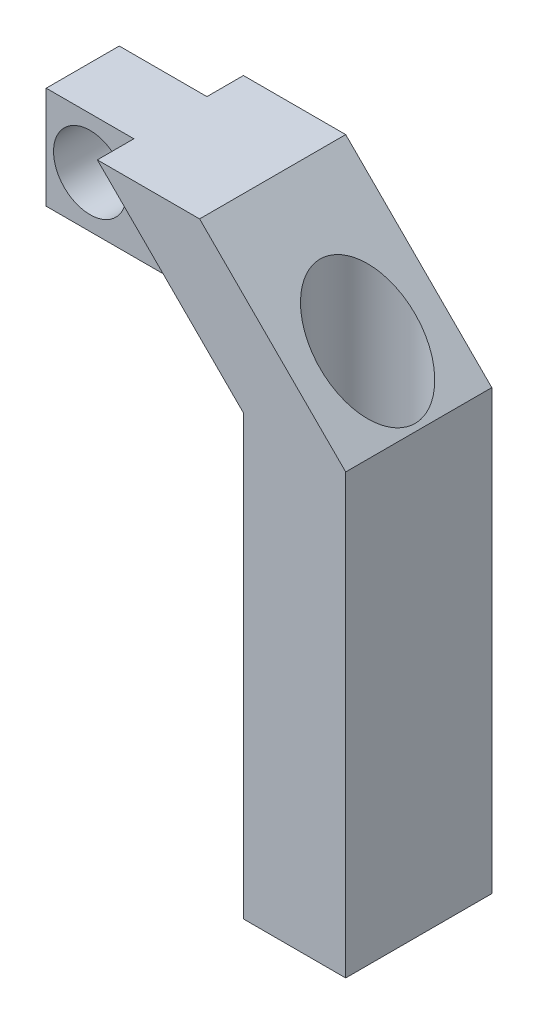
ISO-10303-21;
HEADER;
FILE_DESCRIPTION(('STEP AP214'),'2;1');
FILE_NAME('part.step','',(''),(''),'','','');
FILE_SCHEMA(('AUTOMOTIVE_DESIGN { 1 0 10303 214 1 1 1 1 }'));
ENDSEC;
DATA;
#1=APPLICATION_CONTEXT('core data for automotive mechanical design processes');
#2=APPLICATION_PROTOCOL_DEFINITION('international standard','automotive_design',2000,#1);
#3=PRODUCT_CONTEXT('',#1,'mechanical');
#4=PRODUCT('Part','Part','',(#3));
#5=PRODUCT_RELATED_PRODUCT_CATEGORY('part','',(#4));
#6=PRODUCT_DEFINITION_FORMATION('','',#4);
#7=PRODUCT_DEFINITION_CONTEXT('part definition',#1,'design');
#8=PRODUCT_DEFINITION('design','',#6,#7);
#9=PRODUCT_DEFINITION_SHAPE('','',#8);
#10=(LENGTH_UNIT() NAMED_UNIT(*) SI_UNIT(.MILLI.,.METRE.));
#11=(NAMED_UNIT(*) PLANE_ANGLE_UNIT() SI_UNIT($,.RADIAN.));
#12=(NAMED_UNIT(*) SI_UNIT($,.STERADIAN.) SOLID_ANGLE_UNIT());
#13=UNCERTAINTY_MEASURE_WITH_UNIT(LENGTH_MEASURE(1.E-05),#10,'distance_accuracy_value','');
#14=(GEOMETRIC_REPRESENTATION_CONTEXT(3) GLOBAL_UNCERTAINTY_ASSIGNED_CONTEXT((#13)) GLOBAL_UNIT_ASSIGNED_CONTEXT((#10,
#11,#12)) REPRESENTATION_CONTEXT('',''));
#15=CARTESIAN_POINT('',(0.,0.,0.));
#16=DIRECTION('',(0.,0.,1.));
#17=DIRECTION('',(1.,0.,0.));
#18=AXIS2_PLACEMENT_3D('',#15,#16,#17);
#19=CARTESIAN_POINT('',(0.,0.,5.));
#20=DIRECTION('',(-0.707106781186547,-0.707106781186548,0.));
#21=DIRECTION('',(0.707106781186548,-0.707106781186547,0.));
#22=AXIS2_PLACEMENT_3D('',#19,#20,#21);
#23=PLANE('',#22);
#24=CARTESIAN_POINT('',(-3.5,3.5,0.));
#25=DIRECTION('',(-0.707106781186547,-0.707106781186548,0.));
#26=DIRECTION('',(0.707106781186548,-0.707106781186547,0.));
#27=AXIS2_PLACEMENT_3D('',#24,#25,#26);
#28=ELLIPSE('',#27,4.59619407771256,3.25);
#29=CARTESIAN_POINT('',(-0.25,0.249999999999999,0.));
#30=VERTEX_POINT('',#29);
#31=EDGE_CURVE('E161',#30,#30,#28,.T.);
#32=ORIENTED_EDGE('',*,*,#31,.T.);
#33=EDGE_LOOP('',(#32));
#34=FACE_BOUND('',#33,.T.);
#35=DIRECTION('',(-0.707106781186548,0.707106781186547,0.));
#36=VECTOR('',#35,1.);
#37=CARTESIAN_POINT('',(0.,0.,-5.));
#38=LINE('',#37,#36);
#39=CARTESIAN_POINT('',(0.,0.,-5.));
#40=VERTEX_POINT('',#39);
#41=CARTESIAN_POINT('',(-10.,10.,-5.));
#42=VERTEX_POINT('',#41);
#43=EDGE_CURVE('E164',#40,#42,#38,.T.);
#44=ORIENTED_EDGE('',*,*,#43,.T.);
#45=DIRECTION('',(0.,0.,-1.));
#46=VECTOR('',#45,1.);
#47=CARTESIAN_POINT('',(-10.,10.,5.));
#48=LINE('',#47,#46);
#49=CARTESIAN_POINT('',(-10.,10.,5.));
#50=VERTEX_POINT('',#49);
#51=EDGE_CURVE('E185',#50,#42,#48,.T.);
#52=ORIENTED_EDGE('',*,*,#51,.F.);
#53=DIRECTION('',(-0.707106781186548,0.707106781186547,0.));
#54=VECTOR('',#53,1.);
#55=CARTESIAN_POINT('',(0.,0.,5.));
#56=LINE('',#55,#54);
#57=CARTESIAN_POINT('',(0.,0.,5.));
#58=VERTEX_POINT('',#57);
#59=EDGE_CURVE('E165',#58,#50,#56,.T.);
#60=ORIENTED_EDGE('',*,*,#59,.F.);
#61=DIRECTION('',(0.,0.,-1.));
#62=VECTOR('',#61,1.);
#63=CARTESIAN_POINT('',(0.,0.,5.));
#64=LINE('',#63,#62);
#65=EDGE_CURVE('E131',#58,#40,#64,.T.);
#66=ORIENTED_EDGE('',*,*,#65,.T.);
#67=EDGE_LOOP('',(#44,#52,#60,#66));
#68=FACE_BOUND('',#67,.T.);
#69=ADVANCED_FACE('F33',(#34,#68),#23,.F.);
#70=CARTESIAN_POINT('',(-10.,10.,5.));
#71=DIRECTION('',(0.,-1.,0.));
#72=DIRECTION('',(1.,0.,0.));
#73=AXIS2_PLACEMENT_3D('',#70,#71,#72);
#74=PLANE('',#73);
#75=ORIENTED_EDGE('',*,*,#51,.T.);
#76=DIRECTION('',(-1.,0.,0.));
#77=VECTOR('',#76,1.);
#78=CARTESIAN_POINT('',(-10.,10.,-5.));
#79=LINE('',#78,#77);
#80=CARTESIAN_POINT('',(-17.,10.,-5.));
#81=VERTEX_POINT('',#80);
#82=EDGE_CURVE('E174',#42,#81,#79,.T.);
#83=ORIENTED_EDGE('',*,*,#82,.T.);
#84=DIRECTION('',(0.,0.,-1.));
#85=VECTOR('',#84,1.);
#86=CARTESIAN_POINT('',(-17.,10.,5.));
#87=LINE('',#86,#85);
#88=CARTESIAN_POINT('',(-17.,10.,-2.5));
#89=VERTEX_POINT('',#88);
#90=EDGE_CURVE('E182',#89,#81,#87,.T.);
#91=ORIENTED_EDGE('',*,*,#90,.F.);
#92=DIRECTION('',(-1.,0.,0.));
#93=VECTOR('',#92,1.);
#94=CARTESIAN_POINT('',(-10.,10.,-2.5));
#95=LINE('',#94,#93);
#96=CARTESIAN_POINT('',(-23.,10.,-2.5));
#97=VERTEX_POINT('',#96);
#98=EDGE_CURVE('E148',#89,#97,#95,.T.);
#99=ORIENTED_EDGE('',*,*,#98,.T.);
#100=DIRECTION('',(0.,0.,-1.));
#101=VECTOR('',#100,1.);
#102=CARTESIAN_POINT('',(-23.,10.,2.5));
#103=LINE('',#102,#101);
#104=CARTESIAN_POINT('',(-23.,10.,2.5));
#105=VERTEX_POINT('',#104);
#106=EDGE_CURVE('E158',#105,#97,#103,.T.);
#107=ORIENTED_EDGE('',*,*,#106,.F.);
#108=DIRECTION('',(-1.,0.,0.));
#109=VECTOR('',#108,1.);
#110=CARTESIAN_POINT('',(-10.,10.,2.5));
#111=LINE('',#110,#109);
#112=CARTESIAN_POINT('',(-17.,10.,2.5));
#113=VERTEX_POINT('',#112);
#114=EDGE_CURVE('E140',#113,#105,#111,.T.);
#115=ORIENTED_EDGE('',*,*,#114,.F.);
#116=CARTESIAN_POINT('',(-17.,10.,5.));
#117=VERTEX_POINT('',#116);
#118=EDGE_CURVE('E183',#117,#113,#87,.T.);
#119=ORIENTED_EDGE('',*,*,#118,.F.);
#120=DIRECTION('',(-1.,0.,0.));
#121=VECTOR('',#120,1.);
#122=CARTESIAN_POINT('',(-10.,10.,5.));
#123=LINE('',#122,#121);
#124=EDGE_CURVE('E167',#50,#117,#123,.T.);
#125=ORIENTED_EDGE('',*,*,#124,.F.);
#126=EDGE_LOOP('',(#75,#83,#91,#99,#107,#115,#119,#125));
#127=FACE_BOUND('',#126,.T.);
#128=ADVANCED_FACE('F203',(#127),#74,.F.);
#129=CARTESIAN_POINT('',(-7.,0.,5.));
#130=DIRECTION('',(0.707106781186547,0.707106781186548,0.));
#131=DIRECTION('',(-0.707106781186548,0.707106781186547,0.));
#132=AXIS2_PLACEMENT_3D('',#129,#130,#131);
#133=PLANE('',#132);
#134=ORIENTED_EDGE('',*,*,#118,.T.);
#135=DIRECTION('',(0.707106781186548,-0.707106781186547,0.));
#136=VECTOR('',#135,1.);
#137=CARTESIAN_POINT('',(-7.,0.,2.5));
#138=LINE('',#137,#136);
#139=CARTESIAN_POINT('',(-10.,3.,2.5));
#140=VERTEX_POINT('',#139);
#141=EDGE_CURVE('E11',#113,#140,#138,.T.);
#142=ORIENTED_EDGE('',*,*,#141,.T.);
#143=DIRECTION('',(0.,0.,-1.));
#144=VECTOR('',#143,1.);
#145=CARTESIAN_POINT('',(-10.,3.,2.5));
#146=LINE('',#145,#144);
#147=CARTESIAN_POINT('',(-10.,3.,-2.5));
#148=VERTEX_POINT('',#147);
#149=EDGE_CURVE('E147',#140,#148,#146,.T.);
#150=ORIENTED_EDGE('',*,*,#149,.T.);
#151=DIRECTION('',(0.707106781186548,-0.707106781186547,0.));
#152=VECTOR('',#151,1.);
#153=CARTESIAN_POINT('',(-7.,0.,-2.5));
#154=LINE('',#153,#152);
#155=EDGE_CURVE('E41',#89,#148,#154,.T.);
#156=ORIENTED_EDGE('',*,*,#155,.F.);
#157=ORIENTED_EDGE('',*,*,#90,.T.);
#158=DIRECTION('',(0.707106781186548,-0.707106781186547,0.));
#159=VECTOR('',#158,1.);
#160=CARTESIAN_POINT('',(-7.,0.,-5.));
#161=LINE('',#160,#159);
#162=CARTESIAN_POINT('',(-7.,0.,-5.));
#163=VERTEX_POINT('',#162);
#164=EDGE_CURVE('E168',#81,#163,#161,.T.);
#165=ORIENTED_EDGE('',*,*,#164,.T.);
#166=DIRECTION('',(0.,0.,-1.));
#167=VECTOR('',#166,1.);
#168=CARTESIAN_POINT('',(-7.,0.,5.));
#169=LINE('',#168,#167);
#170=CARTESIAN_POINT('',(-7.,0.,5.));
#171=VERTEX_POINT('',#170);
#172=EDGE_CURVE('E179',#171,#163,#169,.T.);
#173=ORIENTED_EDGE('',*,*,#172,.F.);
#174=DIRECTION('',(0.707106781186548,-0.707106781186547,0.));
#175=VECTOR('',#174,1.);
#176=CARTESIAN_POINT('',(-7.,0.,5.));
#177=LINE('',#176,#175);
#178=EDGE_CURVE('E170',#117,#171,#177,.T.);
#179=ORIENTED_EDGE('',*,*,#178,.F.);
#180=EDGE_LOOP('',(#134,#142,#150,#156,#157,#165,#173,#179));
#181=FACE_BOUND('',#180,.T.);
#182=ADVANCED_FACE('F207',(#181),#133,.F.);
#183=CARTESIAN_POINT('',(0.,0.,5.));
#184=DIRECTION('',(0.,0.,1.));
#185=DIRECTION('',(1.,0.,0.));
#186=AXIS2_PLACEMENT_3D('',#183,#184,#185);
#187=PLANE('',#186);
#188=ORIENTED_EDGE('',*,*,#59,.T.);
#189=ORIENTED_EDGE('',*,*,#124,.T.);
#190=ORIENTED_EDGE('',*,*,#178,.T.);
#191=DIRECTION('',(0.,1.,0.));
#192=VECTOR('',#191,1.);
#193=CARTESIAN_POINT('',(-7.,-30.,5.));
#194=LINE('',#193,#192);
#195=CARTESIAN_POINT('',(-7.,-30.,5.));
#196=VERTEX_POINT('',#195);
#197=EDGE_CURVE('E114',#196,#171,#194,.T.);
#198=ORIENTED_EDGE('',*,*,#197,.F.);
#199=DIRECTION('',(-1.,0.,0.));
#200=VECTOR('',#199,1.);
#201=CARTESIAN_POINT('',(0.,-30.,5.));
#202=LINE('',#201,#200);
#203=CARTESIAN_POINT('',(0.,-30.,5.));
#204=VERTEX_POINT('',#203);
#205=EDGE_CURVE('E106',#204,#196,#202,.T.);
#206=ORIENTED_EDGE('',*,*,#205,.F.);
#207=DIRECTION('',(0.,1.,0.));
#208=VECTOR('',#207,1.);
#209=CARTESIAN_POINT('',(0.,-30.,5.));
#210=LINE('',#209,#208);
#211=EDGE_CURVE('E111',#204,#58,#210,.T.);
#212=ORIENTED_EDGE('',*,*,#211,.T.);
#213=EDGE_LOOP('',(#188,#189,#190,#198,#206,#212));
#214=FACE_BOUND('',#213,.T.);
#215=ADVANCED_FACE('F109',(#214),#187,.T.);
#216=CARTESIAN_POINT('',(0.,0.,-5.));
#217=DIRECTION('',(0.,0.,1.));
#218=DIRECTION('',(1.,0.,0.));
#219=AXIS2_PLACEMENT_3D('',#216,#217,#218);
#220=PLANE('',#219);
#221=ORIENTED_EDGE('',*,*,#43,.F.);
#222=DIRECTION('',(0.,1.,0.));
#223=VECTOR('',#222,1.);
#224=CARTESIAN_POINT('',(0.,-30.,-5.));
#225=LINE('',#224,#223);
#226=CARTESIAN_POINT('',(0.,-30.,-5.));
#227=VERTEX_POINT('',#226);
#228=EDGE_CURVE('E217',#227,#40,#225,.T.);
#229=ORIENTED_EDGE('',*,*,#228,.F.);
#230=DIRECTION('',(1.,0.,0.));
#231=VECTOR('',#230,1.);
#232=CARTESIAN_POINT('',(0.,-30.,-5.));
#233=LINE('',#232,#231);
#234=CARTESIAN_POINT('',(-7.,-30.,-5.));
#235=VERTEX_POINT('',#234);
#236=EDGE_CURVE('E124',#235,#227,#233,.T.);
#237=ORIENTED_EDGE('',*,*,#236,.F.);
#238=DIRECTION('',(0.,1.,0.));
#239=VECTOR('',#238,1.);
#240=CARTESIAN_POINT('',(-7.,-30.,-5.));
#241=LINE('',#240,#239);
#242=EDGE_CURVE('E136',#235,#163,#241,.T.);
#243=ORIENTED_EDGE('',*,*,#242,.T.);
#244=ORIENTED_EDGE('',*,*,#164,.F.);
#245=ORIENTED_EDGE('',*,*,#82,.F.);
#246=EDGE_LOOP('',(#221,#229,#237,#243,#244,#245));
#247=FACE_BOUND('',#246,.T.);
#248=ADVANCED_FACE('F216',(#247),#220,.F.);
#249=CARTESIAN_POINT('',(-3.5,10.,0.));
#250=DIRECTION('',(0.,-1.,0.));
#251=DIRECTION('',(1.,0.,0.));
#252=AXIS2_PLACEMENT_3D('',#249,#250,#251);
#253=CYLINDRICAL_SURFACE('',#252,3.25);
#254=ORIENTED_EDGE('',*,*,#31,.F.);
#255=EDGE_LOOP('',(#254));
#256=FACE_BOUND('',#255,.T.);
#257=CARTESIAN_POINT('',(-3.5,-30.,0.));
#258=DIRECTION('',(0.,-1.,0.));
#259=DIRECTION('',(1.,0.,0.));
#260=AXIS2_PLACEMENT_3D('',#257,#258,#259);
#261=CIRCLE('',#260,3.25);
#262=CARTESIAN_POINT('',(-0.249999999999996,-30.,0.));
#263=VERTEX_POINT('',#262);
#264=EDGE_CURVE('E128',#263,#263,#261,.T.);
#265=ORIENTED_EDGE('',*,*,#264,.T.);
#266=EDGE_LOOP('',(#265));
#267=FACE_BOUND('',#266,.T.);
#268=ADVANCED_FACE('F225',(#256,#267),#253,.F.);
#269=CARTESIAN_POINT('',(0.,0.,2.5));
#270=DIRECTION('',(0.,0.,1.));
#271=DIRECTION('',(1.,0.,0.));
#272=AXIS2_PLACEMENT_3D('',#269,#270,#271);
#273=PLANE('',#272);
#274=CARTESIAN_POINT('',(-20.,6.5,2.5));
#275=DIRECTION('',(0.,0.,1.));
#276=DIRECTION('',(1.,0.,0.));
#277=AXIS2_PLACEMENT_3D('',#274,#275,#276);
#278=CIRCLE('',#277,2.5);
#279=CARTESIAN_POINT('',(-17.5,6.5,2.5));
#280=VERTEX_POINT('',#279);
#281=EDGE_CURVE('E132',#280,#280,#278,.T.);
#282=ORIENTED_EDGE('',*,*,#281,.F.);
#283=EDGE_LOOP('',(#282));
#284=FACE_BOUND('',#283,.T.);
#285=ORIENTED_EDGE('',*,*,#141,.F.);
#286=ORIENTED_EDGE('',*,*,#114,.T.);
#287=DIRECTION('',(0.,-1.,0.));
#288=VECTOR('',#287,1.);
#289=CARTESIAN_POINT('',(-23.,3.,2.5));
#290=LINE('',#289,#288);
#291=CARTESIAN_POINT('',(-23.,3.,2.5));
#292=VERTEX_POINT('',#291);
#293=EDGE_CURVE('E142',#105,#292,#290,.T.);
#294=ORIENTED_EDGE('',*,*,#293,.T.);
#295=DIRECTION('',(1.,0.,0.));
#296=VECTOR('',#295,1.);
#297=CARTESIAN_POINT('',(-10.,3.,2.5));
#298=LINE('',#297,#296);
#299=EDGE_CURVE('E145',#292,#140,#298,.T.);
#300=ORIENTED_EDGE('',*,*,#299,.T.);
#301=EDGE_LOOP('',(#285,#286,#294,#300));
#302=FACE_BOUND('',#301,.T.);
#303=ADVANCED_FACE('F249',(#284,#302),#273,.T.);
#304=CARTESIAN_POINT('',(0.,0.,-2.5));
#305=DIRECTION('',(0.,0.,1.));
#306=DIRECTION('',(1.,0.,0.));
#307=AXIS2_PLACEMENT_3D('',#304,#305,#306);
#308=PLANE('',#307);
#309=CARTESIAN_POINT('',(-20.,6.5,-2.5));
#310=DIRECTION('',(0.,0.,1.));
#311=DIRECTION('',(1.,0.,0.));
#312=AXIS2_PLACEMENT_3D('',#309,#310,#311);
#313=CIRCLE('',#312,2.5);
#314=CARTESIAN_POINT('',(-17.5,6.5,-2.5));
#315=VERTEX_POINT('',#314);
#316=EDGE_CURVE('E36',#315,#315,#313,.T.);
#317=ORIENTED_EDGE('',*,*,#316,.T.);
#318=EDGE_LOOP('',(#317));
#319=FACE_BOUND('',#318,.T.);
#320=ORIENTED_EDGE('',*,*,#98,.F.);
#321=ORIENTED_EDGE('',*,*,#155,.T.);
#322=DIRECTION('',(1.,0.,0.));
#323=VECTOR('',#322,1.);
#324=CARTESIAN_POINT('',(-10.,3.,-2.5));
#325=LINE('',#324,#323);
#326=CARTESIAN_POINT('',(-23.,3.,-2.5));
#327=VERTEX_POINT('',#326);
#328=EDGE_CURVE('E143',#327,#148,#325,.T.);
#329=ORIENTED_EDGE('',*,*,#328,.F.);
#330=DIRECTION('',(0.,-1.,0.));
#331=VECTOR('',#330,1.);
#332=CARTESIAN_POINT('',(-23.,3.,-2.5));
#333=LINE('',#332,#331);
#334=EDGE_CURVE('E150',#97,#327,#333,.T.);
#335=ORIENTED_EDGE('',*,*,#334,.F.);
#336=EDGE_LOOP('',(#320,#321,#329,#335));
#337=FACE_BOUND('',#336,.T.);
#338=ADVANCED_FACE('F190',(#319,#337),#308,.F.);
#339=CARTESIAN_POINT('',(-23.,3.,2.5));
#340=DIRECTION('',(1.,0.,0.));
#341=DIRECTION('',(0.,0.,-1.));
#342=AXIS2_PLACEMENT_3D('',#339,#340,#341);
#343=PLANE('',#342);
#344=ORIENTED_EDGE('',*,*,#334,.T.);
#345=DIRECTION('',(0.,0.,-1.));
#346=VECTOR('',#345,1.);
#347=CARTESIAN_POINT('',(-23.,3.,2.5));
#348=LINE('',#347,#346);
#349=EDGE_CURVE('E155',#292,#327,#348,.T.);
#350=ORIENTED_EDGE('',*,*,#349,.F.);
#351=ORIENTED_EDGE('',*,*,#293,.F.);
#352=ORIENTED_EDGE('',*,*,#106,.T.);
#353=EDGE_LOOP('',(#344,#350,#351,#352));
#354=FACE_BOUND('',#353,.T.);
#355=ADVANCED_FACE('F199',(#354),#343,.F.);
#356=CARTESIAN_POINT('',(-10.,3.,2.5));
#357=DIRECTION('',(0.,1.,0.));
#358=DIRECTION('',(-1.,0.,0.));
#359=AXIS2_PLACEMENT_3D('',#356,#357,#358);
#360=PLANE('',#359);
#361=ORIENTED_EDGE('',*,*,#328,.T.);
#362=ORIENTED_EDGE('',*,*,#149,.F.);
#363=ORIENTED_EDGE('',*,*,#299,.F.);
#364=ORIENTED_EDGE('',*,*,#349,.T.);
#365=EDGE_LOOP('',(#361,#362,#363,#364));
#366=FACE_BOUND('',#365,.T.);
#367=ADVANCED_FACE('F194',(#366),#360,.F.);
#368=CARTESIAN_POINT('',(-20.,6.5,-5.));
#369=DIRECTION('',(0.,0.,1.));
#370=DIRECTION('',(1.,0.,0.));
#371=AXIS2_PLACEMENT_3D('',#368,#369,#370);
#372=CYLINDRICAL_SURFACE('',#371,2.5);
#373=ORIENTED_EDGE('',*,*,#281,.T.);
#374=EDGE_LOOP('',(#373));
#375=FACE_BOUND('',#374,.T.);
#376=ORIENTED_EDGE('',*,*,#316,.F.);
#377=EDGE_LOOP('',(#376));
#378=FACE_BOUND('',#377,.T.);
#379=ADVANCED_FACE('F227',(#375,#378),#372,.F.);
#380=CARTESIAN_POINT('',(0.,-30.,0.));
#381=DIRECTION('',(0.,1.,0.));
#382=DIRECTION('',(-1.,0.,0.));
#383=AXIS2_PLACEMENT_3D('',#380,#381,#382);
#384=PLANE('',#383);
#385=DIRECTION('',(0.,0.,1.));
#386=VECTOR('',#385,1.);
#387=CARTESIAN_POINT('',(0.,-30.,5.));
#388=LINE('',#387,#386);
#389=EDGE_CURVE('E118',#227,#204,#388,.T.);
#390=ORIENTED_EDGE('',*,*,#389,.T.);
#391=ORIENTED_EDGE('',*,*,#205,.T.);
#392=DIRECTION('',(0.,0.,-1.));
#393=VECTOR('',#392,1.);
#394=CARTESIAN_POINT('',(-7.,-30.,5.));
#395=LINE('',#394,#393);
#396=EDGE_CURVE('E117',#196,#235,#395,.T.);
#397=ORIENTED_EDGE('',*,*,#396,.T.);
#398=ORIENTED_EDGE('',*,*,#236,.T.);
#399=EDGE_LOOP('',(#390,#391,#397,#398));
#400=FACE_BOUND('',#399,.T.);
#401=ORIENTED_EDGE('',*,*,#264,.F.);
#402=EDGE_LOOP('',(#401));
#403=FACE_BOUND('',#402,.T.);
#404=ADVANCED_FACE('F121',(#400,#403),#384,.F.);
#405=CARTESIAN_POINT('',(0.,-30.,5.));
#406=DIRECTION('',(-1.,0.,0.));
#407=DIRECTION('',(0.,-1.,0.));
#408=AXIS2_PLACEMENT_3D('',#405,#406,#407);
#409=PLANE('',#408);
#410=ORIENTED_EDGE('',*,*,#65,.F.);
#411=ORIENTED_EDGE('',*,*,#211,.F.);
#412=ORIENTED_EDGE('',*,*,#389,.F.);
#413=ORIENTED_EDGE('',*,*,#228,.T.);
#414=EDGE_LOOP('',(#410,#411,#412,#413));
#415=FACE_BOUND('',#414,.T.);
#416=ADVANCED_FACE('F130',(#415),#409,.F.);
#417=CARTESIAN_POINT('',(-7.,-30.,5.));
#418=DIRECTION('',(1.,0.,0.));
#419=DIRECTION('',(0.,1.,0.));
#420=AXIS2_PLACEMENT_3D('',#417,#418,#419);
#421=PLANE('',#420);
#422=ORIENTED_EDGE('',*,*,#172,.T.);
#423=ORIENTED_EDGE('',*,*,#242,.F.);
#424=ORIENTED_EDGE('',*,*,#396,.F.);
#425=ORIENTED_EDGE('',*,*,#197,.T.);
#426=EDGE_LOOP('',(#422,#423,#424,#425));
#427=FACE_BOUND('',#426,.T.);
#428=ADVANCED_FACE('F214',(#427),#421,.F.);
#429=CLOSED_SHELL('',(#69,#128,#182,#215,#248,#268,#303,#338,#355,#367,#379,#404,#416,#428));
#430=MANIFOLD_SOLID_BREP('B2',#429);
#431=ADVANCED_BREP_SHAPE_REPRESENTATION('',(#18,#430),#14);
#432=SHAPE_DEFINITION_REPRESENTATION(#9,#431);
ENDSEC;
END-ISO-10303-21;
